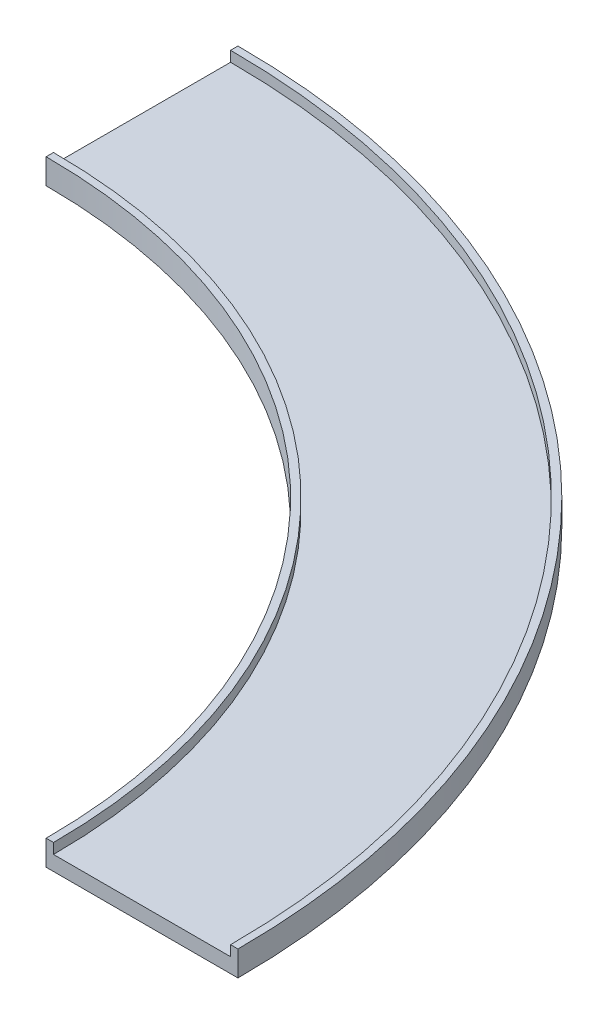
ISO-10303-21;
HEADER;
FILE_DESCRIPTION(('STEP AP214'),'2;1');
FILE_NAME('part.step','',(''),(''),'','','');
FILE_SCHEMA(('AUTOMOTIVE_DESIGN { 1 0 10303 214 1 1 1 1 }'));
ENDSEC;
DATA;
#1=APPLICATION_CONTEXT('core data for automotive mechanical design processes');
#2=APPLICATION_PROTOCOL_DEFINITION('international standard','automotive_design',2000,#1);
#3=PRODUCT_CONTEXT('',#1,'mechanical');
#4=PRODUCT('Part','Part','',(#3));
#5=PRODUCT_RELATED_PRODUCT_CATEGORY('part','',(#4));
#6=PRODUCT_DEFINITION_FORMATION('','',#4);
#7=PRODUCT_DEFINITION_CONTEXT('part definition',#1,'design');
#8=PRODUCT_DEFINITION('design','',#6,#7);
#9=PRODUCT_DEFINITION_SHAPE('','',#8);
#10=(LENGTH_UNIT() NAMED_UNIT(*) SI_UNIT(.MILLI.,.METRE.));
#11=(NAMED_UNIT(*) PLANE_ANGLE_UNIT() SI_UNIT($,.RADIAN.));
#12=(NAMED_UNIT(*) SI_UNIT($,.STERADIAN.) SOLID_ANGLE_UNIT());
#13=UNCERTAINTY_MEASURE_WITH_UNIT(LENGTH_MEASURE(1.E-05),#10,'distance_accuracy_value','');
#14=(GEOMETRIC_REPRESENTATION_CONTEXT(3) GLOBAL_UNCERTAINTY_ASSIGNED_CONTEXT((#13)) GLOBAL_UNIT_ASSIGNED_CONTEXT((#10,
#11,#12)) REPRESENTATION_CONTEXT('',''));
#15=CARTESIAN_POINT('',(0.,0.,0.));
#16=DIRECTION('',(0.,0.,1.));
#17=DIRECTION('',(1.,0.,0.));
#18=AXIS2_PLACEMENT_3D('',#15,#16,#17);
#19=CARTESIAN_POINT('',(-2000.,0.,0.));
#20=DIRECTION('',(0.,-1.,0.));
#21=DIRECTION('',(0.,0.,-1.));
#22=AXIS2_PLACEMENT_3D('',#19,#20,#21);
#23=CYLINDRICAL_SURFACE('',#22,2025.);
#24=CARTESIAN_POINT('',(-2000.,0.,0.));
#25=DIRECTION('',(0.,-1.,0.));
#26=DIRECTION('',(0.,0.,-1.));
#27=AXIS2_PLACEMENT_3D('',#24,#25,#26);
#28=CIRCLE('',#27,2025.);
#29=CARTESIAN_POINT('',(-2000.00000000001,0.,-2025.));
#30=VERTEX_POINT('',#29);
#31=CARTESIAN_POINT('',(25.,0.,0.));
#32=VERTEX_POINT('',#31);
#33=EDGE_CURVE('E11',#30,#32,#28,.T.);
#34=ORIENTED_EDGE('',*,*,#33,.T.);
#35=DIRECTION('',(0.,-1.,0.));
#36=VECTOR('',#35,1.);
#37=CARTESIAN_POINT('',(25.,0.,0.));
#38=LINE('',#37,#36);
#39=CARTESIAN_POINT('',(25.,-35.2360817477097,0.));
#40=VERTEX_POINT('',#39);
#41=EDGE_CURVE('E115',#32,#40,#38,.T.);
#42=ORIENTED_EDGE('',*,*,#41,.T.);
#43=CARTESIAN_POINT('',(-2000.,-35.2360817477097,0.));
#44=DIRECTION('',(0.,-1.,0.));
#45=DIRECTION('',(0.,0.,-1.));
#46=AXIS2_PLACEMENT_3D('',#43,#44,#45);
#47=CIRCLE('',#46,2025.);
#48=CARTESIAN_POINT('',(-2000.00000000001,-35.2360817477097,-2025.));
#49=VERTEX_POINT('',#48);
#50=EDGE_CURVE('E97',#49,#40,#47,.T.);
#51=ORIENTED_EDGE('',*,*,#50,.F.);
#52=DIRECTION('',(0.,-1.,0.));
#53=VECTOR('',#52,1.);
#54=CARTESIAN_POINT('',(-2000.00000000001,0.,-2025.));
#55=LINE('',#54,#53);
#56=EDGE_CURVE('E136',#30,#49,#55,.T.);
#57=ORIENTED_EDGE('',*,*,#56,.F.);
#58=EDGE_LOOP('',(#34,#42,#51,#57));
#59=FACE_BOUND('',#58,.T.);
#60=ADVANCED_FACE('F33',(#59),#23,.T.);
#61=CARTESIAN_POINT('',(-2000.00000000001,0.,-2000.));
#62=DIRECTION('',(0.,-1.,0.));
#63=DIRECTION('',(0.,0.,-1.));
#64=AXIS2_PLACEMENT_3D('',#61,#62,#63);
#65=PLANE('',#64);
#66=CARTESIAN_POINT('',(-2000.,0.,0.));
#67=DIRECTION('',(0.,-1.,0.));
#68=DIRECTION('',(0.,0.,-1.));
#69=AXIS2_PLACEMENT_3D('',#66,#67,#68);
#70=CIRCLE('',#69,2000.);
#71=CARTESIAN_POINT('',(-2000.00000000001,0.,-2000.));
#72=VERTEX_POINT('',#71);
#73=CARTESIAN_POINT('',(0.,0.,0.));
#74=VERTEX_POINT('',#73);
#75=EDGE_CURVE('E41',#72,#74,#70,.T.);
#76=ORIENTED_EDGE('',*,*,#75,.T.);
#77=DIRECTION('',(1.,0.,0.));
#78=VECTOR('',#77,1.);
#79=CARTESIAN_POINT('',(0.,0.,0.));
#80=LINE('',#79,#78);
#81=EDGE_CURVE('E134',#74,#32,#80,.T.);
#82=ORIENTED_EDGE('',*,*,#81,.T.);
#83=ORIENTED_EDGE('',*,*,#33,.F.);
#84=DIRECTION('',(0.,0.,-1.));
#85=VECTOR('',#84,1.);
#86=CARTESIAN_POINT('',(-2000.00000000001,0.,-2000.));
#87=LINE('',#86,#85);
#88=EDGE_CURVE('E109',#72,#30,#87,.T.);
#89=ORIENTED_EDGE('',*,*,#88,.F.);
#90=EDGE_LOOP('',(#76,#82,#83,#89));
#91=FACE_BOUND('',#90,.T.);
#92=ADVANCED_FACE('F35',(#91),#65,.F.);
#93=CARTESIAN_POINT('',(-2000.,0.,0.));
#94=DIRECTION('',(0.,-1.,0.));
#95=DIRECTION('',(0.,0.,-1.));
#96=AXIS2_PLACEMENT_3D('',#93,#94,#95);
#97=CYLINDRICAL_SURFACE('',#96,2000.);
#98=CARTESIAN_POINT('',(-2000.,-85.2360817477096,0.));
#99=DIRECTION('',(0.,-1.,0.));
#100=DIRECTION('',(0.,0.,-1.));
#101=AXIS2_PLACEMENT_3D('',#98,#99,#100);
#102=CIRCLE('',#101,2000.);
#103=CARTESIAN_POINT('',(-2000.00000000001,-85.2360817477096,-2000.));
#104=VERTEX_POINT('',#103);
#105=CARTESIAN_POINT('',(0.,-85.2360817477096,0.));
#106=VERTEX_POINT('',#105);
#107=EDGE_CURVE('E161',#104,#106,#102,.T.);
#108=ORIENTED_EDGE('',*,*,#107,.T.);
#109=DIRECTION('',(0.,1.,0.));
#110=VECTOR('',#109,1.);
#111=CARTESIAN_POINT('',(0.,-85.2360817477096,0.));
#112=LINE('',#111,#110);
#113=EDGE_CURVE('E132',#106,#74,#112,.T.);
#114=ORIENTED_EDGE('',*,*,#113,.T.);
#115=ORIENTED_EDGE('',*,*,#75,.F.);
#116=DIRECTION('',(0.,1.,0.));
#117=VECTOR('',#116,1.);
#118=CARTESIAN_POINT('',(-2000.00000000001,-85.2360817477096,-2000.));
#119=LINE('',#118,#117);
#120=EDGE_CURVE('E151',#104,#72,#119,.T.);
#121=ORIENTED_EDGE('',*,*,#120,.F.);
#122=EDGE_LOOP('',(#108,#114,#115,#121));
#123=FACE_BOUND('',#122,.T.);
#124=ADVANCED_FACE('F163',(#123),#97,.F.);
#125=CARTESIAN_POINT('',(-2000.00000000001,-85.2360817477097,-2650.));
#126=DIRECTION('',(0.,1.,0.));
#127=DIRECTION('',(0.,0.,1.));
#128=AXIS2_PLACEMENT_3D('',#125,#126,#127);
#129=PLANE('',#128);
#130=CARTESIAN_POINT('',(-2000.,-85.2360817477097,0.));
#131=DIRECTION('',(0.,-1.,0.));
#132=DIRECTION('',(0.,0.,-1.));
#133=AXIS2_PLACEMENT_3D('',#130,#131,#132);
#134=CIRCLE('',#133,2650.);
#135=CARTESIAN_POINT('',(-2000.00000000001,-85.2360817477097,-2650.));
#136=VERTEX_POINT('',#135);
#137=CARTESIAN_POINT('',(650.,-85.2360817477097,0.));
#138=VERTEX_POINT('',#137);
#139=EDGE_CURVE('E159',#136,#138,#134,.T.);
#140=ORIENTED_EDGE('',*,*,#139,.T.);
#141=DIRECTION('',(-1.,0.,0.));
#142=VECTOR('',#141,1.);
#143=CARTESIAN_POINT('',(650.,-85.2360817477097,0.));
#144=LINE('',#143,#142);
#145=EDGE_CURVE('E129',#138,#106,#144,.T.);
#146=ORIENTED_EDGE('',*,*,#145,.T.);
#147=ORIENTED_EDGE('',*,*,#107,.F.);
#148=DIRECTION('',(0.,0.,1.));
#149=VECTOR('',#148,1.);
#150=CARTESIAN_POINT('',(-2000.00000000001,-85.2360817477097,-2650.));
#151=LINE('',#150,#149);
#152=EDGE_CURVE('E148',#136,#104,#151,.T.);
#153=ORIENTED_EDGE('',*,*,#152,.F.);
#154=EDGE_LOOP('',(#140,#146,#147,#153));
#155=FACE_BOUND('',#154,.T.);
#156=ADVANCED_FACE('F167',(#155),#129,.F.);
#157=CARTESIAN_POINT('',(-2000.,0.,0.));
#158=DIRECTION('',(0.,-1.,0.));
#159=DIRECTION('',(0.,0.,-1.));
#160=AXIS2_PLACEMENT_3D('',#157,#158,#159);
#161=CYLINDRICAL_SURFACE('',#160,2650.);
#162=CARTESIAN_POINT('',(-2000.,0.,0.));
#163=DIRECTION('',(0.,-1.,0.));
#164=DIRECTION('',(0.,0.,-1.));
#165=AXIS2_PLACEMENT_3D('',#162,#163,#164);
#166=CIRCLE('',#165,2650.);
#167=CARTESIAN_POINT('',(-2000.00000000001,0.,-2650.));
#168=VERTEX_POINT('',#167);
#169=CARTESIAN_POINT('',(650.,0.,0.));
#170=VERTEX_POINT('',#169);
#171=EDGE_CURVE('E157',#168,#170,#166,.T.);
#172=ORIENTED_EDGE('',*,*,#171,.T.);
#173=DIRECTION('',(0.,-1.,0.));
#174=VECTOR('',#173,1.);
#175=CARTESIAN_POINT('',(650.,0.,0.));
#176=LINE('',#175,#174);
#177=EDGE_CURVE('E126',#170,#138,#176,.T.);
#178=ORIENTED_EDGE('',*,*,#177,.T.);
#179=ORIENTED_EDGE('',*,*,#139,.F.);
#180=DIRECTION('',(0.,-1.,0.));
#181=VECTOR('',#180,1.);
#182=CARTESIAN_POINT('',(-2000.00000000001,0.,-2650.));
#183=LINE('',#182,#181);
#184=EDGE_CURVE('E145',#168,#136,#183,.T.);
#185=ORIENTED_EDGE('',*,*,#184,.F.);
#186=EDGE_LOOP('',(#172,#178,#179,#185));
#187=FACE_BOUND('',#186,.T.);
#188=ADVANCED_FACE('F171',(#187),#161,.T.);
#189=CARTESIAN_POINT('',(-2000.00000000001,0.,-2625.));
#190=DIRECTION('',(0.,-1.,0.));
#191=DIRECTION('',(0.,0.,-1.));
#192=AXIS2_PLACEMENT_3D('',#189,#190,#191);
#193=PLANE('',#192);
#194=CARTESIAN_POINT('',(-2000.,0.,0.));
#195=DIRECTION('',(0.,-1.,0.));
#196=DIRECTION('',(0.,0.,-1.));
#197=AXIS2_PLACEMENT_3D('',#194,#195,#196);
#198=CIRCLE('',#197,2625.);
#199=CARTESIAN_POINT('',(-2000.00000000001,0.,-2625.));
#200=VERTEX_POINT('',#199);
#201=CARTESIAN_POINT('',(625.,0.,0.));
#202=VERTEX_POINT('',#201);
#203=EDGE_CURVE('E155',#200,#202,#198,.T.);
#204=ORIENTED_EDGE('',*,*,#203,.T.);
#205=DIRECTION('',(1.,0.,0.));
#206=VECTOR('',#205,1.);
#207=CARTESIAN_POINT('',(625.,0.,0.));
#208=LINE('',#207,#206);
#209=EDGE_CURVE('E123',#202,#170,#208,.T.);
#210=ORIENTED_EDGE('',*,*,#209,.T.);
#211=ORIENTED_EDGE('',*,*,#171,.F.);
#212=DIRECTION('',(0.,0.,-1.));
#213=VECTOR('',#212,1.);
#214=CARTESIAN_POINT('',(-2000.00000000001,0.,-2625.));
#215=LINE('',#214,#213);
#216=EDGE_CURVE('E142',#200,#168,#215,.T.);
#217=ORIENTED_EDGE('',*,*,#216,.F.);
#218=EDGE_LOOP('',(#204,#210,#211,#217));
#219=FACE_BOUND('',#218,.T.);
#220=ADVANCED_FACE('F174',(#219),#193,.F.);
#221=CARTESIAN_POINT('',(-2000.,0.,0.));
#222=DIRECTION('',(0.,-1.,0.));
#223=DIRECTION('',(0.,0.,-1.));
#224=AXIS2_PLACEMENT_3D('',#221,#222,#223);
#225=CYLINDRICAL_SURFACE('',#224,2625.);
#226=CARTESIAN_POINT('',(-2000.,-35.2360817477097,0.));
#227=DIRECTION('',(0.,-1.,0.));
#228=DIRECTION('',(0.,0.,-1.));
#229=AXIS2_PLACEMENT_3D('',#226,#227,#228);
#230=CIRCLE('',#229,2625.);
#231=CARTESIAN_POINT('',(-2000.00000000001,-35.2360817477097,-2625.));
#232=VERTEX_POINT('',#231);
#233=CARTESIAN_POINT('',(625.,-35.2360817477097,0.));
#234=VERTEX_POINT('',#233);
#235=EDGE_CURVE('E108',#232,#234,#230,.T.);
#236=ORIENTED_EDGE('',*,*,#235,.T.);
#237=DIRECTION('',(0.,1.,0.));
#238=VECTOR('',#237,1.);
#239=CARTESIAN_POINT('',(625.,-35.2360817477097,0.));
#240=LINE('',#239,#238);
#241=EDGE_CURVE('E118',#234,#202,#240,.T.);
#242=ORIENTED_EDGE('',*,*,#241,.T.);
#243=ORIENTED_EDGE('',*,*,#203,.F.);
#244=DIRECTION('',(0.,1.,0.));
#245=VECTOR('',#244,1.);
#246=CARTESIAN_POINT('',(-2000.00000000001,-35.2360817477097,-2625.));
#247=LINE('',#246,#245);
#248=EDGE_CURVE('E139',#232,#200,#247,.T.);
#249=ORIENTED_EDGE('',*,*,#248,.F.);
#250=EDGE_LOOP('',(#236,#242,#243,#249));
#251=FACE_BOUND('',#250,.T.);
#252=ADVANCED_FACE('F177',(#251),#225,.F.);
#253=CARTESIAN_POINT('',(-2000.00000000001,-35.2360817477097,-2025.));
#254=DIRECTION('',(0.,-1.,0.));
#255=DIRECTION('',(0.,0.,-1.));
#256=AXIS2_PLACEMENT_3D('',#253,#254,#255);
#257=PLANE('',#256);
#258=DIRECTION('',(0.,0.,-1.));
#259=VECTOR('',#258,1.);
#260=CARTESIAN_POINT('',(-2000.00000000001,-35.2360817477097,-2025.));
#261=LINE('',#260,#259);
#262=EDGE_CURVE('E103',#49,#232,#261,.T.);
#263=ORIENTED_EDGE('',*,*,#262,.F.);
#264=ORIENTED_EDGE('',*,*,#50,.T.);
#265=DIRECTION('',(1.,0.,0.));
#266=VECTOR('',#265,1.);
#267=CARTESIAN_POINT('',(25.,-35.2360817477097,0.));
#268=LINE('',#267,#266);
#269=EDGE_CURVE('E100',#40,#234,#268,.T.);
#270=ORIENTED_EDGE('',*,*,#269,.T.);
#271=ORIENTED_EDGE('',*,*,#235,.F.);
#272=EDGE_LOOP('',(#263,#264,#270,#271));
#273=FACE_BOUND('',#272,.T.);
#274=ADVANCED_FACE('F99',(#273),#257,.F.);
#275=CARTESIAN_POINT('',(-2000.00000000001,0.,-2000.));
#276=DIRECTION('',(1.,0.,0.));
#277=DIRECTION('',(0.,0.,-1.));
#278=AXIS2_PLACEMENT_3D('',#275,#276,#277);
#279=PLANE('',#278);
#280=ORIENTED_EDGE('',*,*,#56,.T.);
#281=ORIENTED_EDGE('',*,*,#262,.T.);
#282=ORIENTED_EDGE('',*,*,#248,.T.);
#283=ORIENTED_EDGE('',*,*,#216,.T.);
#284=ORIENTED_EDGE('',*,*,#184,.T.);
#285=ORIENTED_EDGE('',*,*,#152,.T.);
#286=ORIENTED_EDGE('',*,*,#120,.T.);
#287=ORIENTED_EDGE('',*,*,#88,.T.);
#288=EDGE_LOOP('',(#280,#281,#282,#283,#284,#285,#286,#287));
#289=FACE_BOUND('',#288,.T.);
#290=ADVANCED_FACE('F179',(#289),#279,.F.);
#291=CARTESIAN_POINT('',(0.,0.,0.));
#292=DIRECTION('',(0.,0.,1.));
#293=DIRECTION('',(1.,0.,0.));
#294=AXIS2_PLACEMENT_3D('',#291,#292,#293);
#295=PLANE('',#294);
#296=ORIENTED_EDGE('',*,*,#41,.F.);
#297=ORIENTED_EDGE('',*,*,#81,.F.);
#298=ORIENTED_EDGE('',*,*,#113,.F.);
#299=ORIENTED_EDGE('',*,*,#145,.F.);
#300=ORIENTED_EDGE('',*,*,#177,.F.);
#301=ORIENTED_EDGE('',*,*,#209,.F.);
#302=ORIENTED_EDGE('',*,*,#241,.F.);
#303=ORIENTED_EDGE('',*,*,#269,.F.);
#304=EDGE_LOOP('',(#296,#297,#298,#299,#300,#301,#302,#303));
#305=FACE_BOUND('',#304,.T.);
#306=ADVANCED_FACE('F113',(#305),#295,.T.);
#307=CLOSED_SHELL('',(#60,#92,#124,#156,#188,#220,#252,#274,#290,#306));
#308=MANIFOLD_SOLID_BREP('B2',#307);
#309=ADVANCED_BREP_SHAPE_REPRESENTATION('',(#18,#308),#14);
#310=SHAPE_DEFINITION_REPRESENTATION(#9,#309);
ENDSEC;
END-ISO-10303-21;
